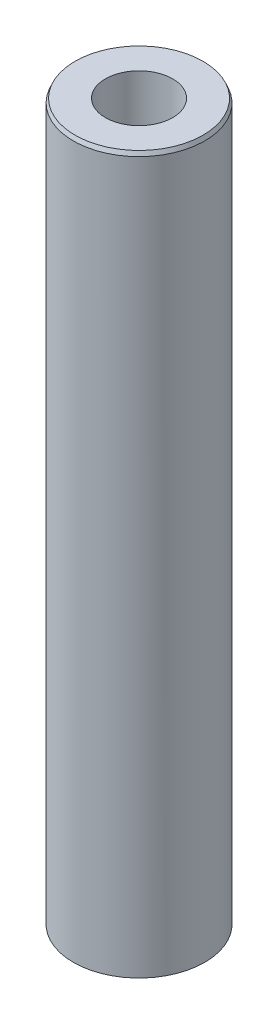
ISO-10303-21;
HEADER;
FILE_DESCRIPTION(('STEP AP214'),'2;1');
FILE_NAME('part.step','',(''),(''),'','','');
FILE_SCHEMA(('AUTOMOTIVE_DESIGN { 1 0 10303 214 1 1 1 1 }'));
ENDSEC;
DATA;
#1=APPLICATION_CONTEXT('core data for automotive mechanical design processes');
#2=APPLICATION_PROTOCOL_DEFINITION('international standard','automotive_design',2000,#1);
#3=PRODUCT_CONTEXT('',#1,'mechanical');
#4=PRODUCT('Part','Part','',(#3));
#5=PRODUCT_RELATED_PRODUCT_CATEGORY('part','',(#4));
#6=PRODUCT_DEFINITION_FORMATION('','',#4);
#7=PRODUCT_DEFINITION_CONTEXT('part definition',#1,'design');
#8=PRODUCT_DEFINITION('design','',#6,#7);
#9=PRODUCT_DEFINITION_SHAPE('','',#8);
#10=(LENGTH_UNIT() NAMED_UNIT(*) SI_UNIT(.MILLI.,.METRE.));
#11=(NAMED_UNIT(*) PLANE_ANGLE_UNIT() SI_UNIT($,.RADIAN.));
#12=(NAMED_UNIT(*) SI_UNIT($,.STERADIAN.) SOLID_ANGLE_UNIT());
#13=UNCERTAINTY_MEASURE_WITH_UNIT(LENGTH_MEASURE(1.E-05),#10,'distance_accuracy_value','');
#14=(GEOMETRIC_REPRESENTATION_CONTEXT(3) GLOBAL_UNCERTAINTY_ASSIGNED_CONTEXT((#13)) GLOBAL_UNIT_ASSIGNED_CONTEXT((#10,
#11,#12)) REPRESENTATION_CONTEXT('',''));
#15=CARTESIAN_POINT('',(0.,0.,0.));
#16=DIRECTION('',(0.,0.,1.));
#17=DIRECTION('',(1.,0.,0.));
#18=AXIS2_PLACEMENT_3D('',#15,#16,#17);
#19=CARTESIAN_POINT('',(0.,600.,0.));
#20=DIRECTION('',(0.,-1.,0.));
#21=DIRECTION('',(0.,0.,-1.));
#22=AXIS2_PLACEMENT_3D('',#19,#20,#21);
#23=CYLINDRICAL_SURFACE('',#22,55.);
#24=CARTESIAN_POINT('',(0.,596.561603427127,0.));
#25=DIRECTION('',(0.,1.,0.));
#26=DIRECTION('',(0.,0.,1.));
#27=AXIS2_PLACEMENT_3D('',#24,#25,#26);
#28=CIRCLE('',#27,55.);
#29=CARTESIAN_POINT('',(0.,596.561603427127,-55.));
#30=VERTEX_POINT('',#29);
#31=EDGE_CURVE('E50',#30,#30,#28,.F.);
#32=ORIENTED_EDGE('',*,*,#31,.T.);
#33=EDGE_LOOP('',(#32));
#34=FACE_BOUND('',#33,.T.);
#35=CARTESIAN_POINT('',(0.,1.44030875950241,0.));
#36=DIRECTION('',(0.,1.,0.));
#37=DIRECTION('',(0.,0.,1.));
#38=AXIS2_PLACEMENT_3D('',#35,#36,#37);
#39=CIRCLE('',#38,55.);
#40=CARTESIAN_POINT('',(0.,1.44030875950241,55.));
#41=VERTEX_POINT('',#40);
#42=EDGE_CURVE('E51',#41,#41,#39,.T.);
#43=ORIENTED_EDGE('',*,*,#42,.T.);
#44=EDGE_LOOP('',(#43));
#45=FACE_BOUND('',#44,.T.);
#46=ADVANCED_FACE('F39',(#34,#45),#23,.T.);
#47=CARTESIAN_POINT('',(0.,600.,0.));
#48=DIRECTION('',(0.,1.,0.));
#49=DIRECTION('',(0.,0.,1.));
#50=AXIS2_PLACEMENT_3D('',#47,#48,#49);
#51=PLANE('',#50);
#52=CARTESIAN_POINT('',(0.,600.,0.));
#53=DIRECTION('',(0.,1.,0.));
#54=DIRECTION('',(0.,0.,1.));
#55=AXIS2_PLACEMENT_3D('',#52,#53,#54);
#56=CIRCLE('',#55,53.5596912404976);
#57=CARTESIAN_POINT('',(0.,600.,-53.5596912404976));
#58=VERTEX_POINT('',#57);
#59=EDGE_CURVE('E54',#58,#58,#56,.T.);
#60=ORIENTED_EDGE('',*,*,#59,.T.);
#61=EDGE_LOOP('',(#60));
#62=FACE_BOUND('',#61,.T.);
#63=CARTESIAN_POINT('',(0.,600.,0.));
#64=DIRECTION('',(0.,1.,0.));
#65=DIRECTION('',(0.,0.,1.));
#66=AXIS2_PLACEMENT_3D('',#63,#64,#65);
#67=CIRCLE('',#66,28.1390764335335);
#68=CARTESIAN_POINT('',(0.,600.,28.1390764335335));
#69=VERTEX_POINT('',#68);
#70=EDGE_CURVE('E58',#69,#69,#67,.T.);
#71=ORIENTED_EDGE('',*,*,#70,.F.);
#72=EDGE_LOOP('',(#71));
#73=FACE_BOUND('',#72,.T.);
#74=ADVANCED_FACE('F69',(#62,#73),#51,.T.);
#75=CARTESIAN_POINT('',(0.,0.,0.));
#76=DIRECTION('',(0.,1.,0.));
#77=DIRECTION('',(0.,0.,1.));
#78=AXIS2_PLACEMENT_3D('',#75,#76,#77);
#79=PLANE('',#78);
#80=CARTESIAN_POINT('',(0.,0.,0.));
#81=DIRECTION('',(0.,1.,0.));
#82=DIRECTION('',(0.,0.,1.));
#83=AXIS2_PLACEMENT_3D('',#80,#81,#82);
#84=CIRCLE('',#83,51.5616034271273);
#85=CARTESIAN_POINT('',(0.,0.,51.5616034271273));
#86=VERTEX_POINT('',#85);
#87=EDGE_CURVE('E10',#86,#86,#84,.F.);
#88=ORIENTED_EDGE('',*,*,#87,.T.);
#89=EDGE_LOOP('',(#88));
#90=FACE_BOUND('',#89,.T.);
#91=CARTESIAN_POINT('',(0.,0.,0.));
#92=DIRECTION('',(0.,1.,0.));
#93=DIRECTION('',(0.,0.,1.));
#94=AXIS2_PLACEMENT_3D('',#91,#92,#93);
#95=CIRCLE('',#94,28.1390764335335);
#96=CARTESIAN_POINT('',(0.,0.,28.1390764335335));
#97=VERTEX_POINT('',#96);
#98=EDGE_CURVE('E63',#97,#97,#95,.T.);
#99=ORIENTED_EDGE('',*,*,#98,.T.);
#100=EDGE_LOOP('',(#99));
#101=FACE_BOUND('',#100,.T.);
#102=ADVANCED_FACE('F75',(#90,#101),#79,.F.);
#103=CARTESIAN_POINT('',(0.,600.,0.));
#104=DIRECTION('',(0.,-1.,0.));
#105=DIRECTION('',(0.,0.,-1.));
#106=AXIS2_PLACEMENT_3D('',#103,#104,#105);
#107=CYLINDRICAL_SURFACE('',#106,28.1390764335335);
#108=ORIENTED_EDGE('',*,*,#70,.T.);
#109=EDGE_LOOP('',(#108));
#110=FACE_BOUND('',#109,.T.);
#111=ORIENTED_EDGE('',*,*,#98,.F.);
#112=EDGE_LOOP('',(#111));
#113=FACE_BOUND('',#112,.T.);
#114=ADVANCED_FACE('F70',(#110,#113),#107,.F.);
#115=CARTESIAN_POINT('',(0.,600.,0.));
#116=DIRECTION('',(0.,-1.,0.));
#117=DIRECTION('',(0.,0.,-1.));
#118=AXIS2_PLACEMENT_3D('',#115,#116,#117);
#119=CONICAL_SURFACE('',#118,53.5596912404976,0.396683768936142);
#120=CARTESIAN_POINT('',(0.,596.561603427127,-55.));
#121=CARTESIAN_POINT('',(0.,596.597420058095,-54.9849967837552));
#122=CARTESIAN_POINT('',(0.,596.633236689062,-54.9699935675104));
#123=CARTESIAN_POINT('',(0.,596.704869950997,-54.9399871350208));
#124=CARTESIAN_POINT('',(0.,596.740686581964,-54.9249839187759));
#125=CARTESIAN_POINT('',(0.,596.812319843899,-54.8949774862863));
#126=CARTESIAN_POINT('',(0.,596.848136474867,-54.8799742700415));
#127=CARTESIAN_POINT('',(0.,596.919769736802,-54.8499678375519));
#128=CARTESIAN_POINT('',(0.,596.955586367769,-54.834964621307));
#129=CARTESIAN_POINT('',(0.,597.027219629704,-54.8049581888174));
#130=CARTESIAN_POINT('',(0.,597.063036260671,-54.7899549725726));
#131=CARTESIAN_POINT('',(0.,597.134669522606,-54.759948540083));
#132=CARTESIAN_POINT('',(0.,597.170486153574,-54.7449453238381));
#133=CARTESIAN_POINT('',(0.,597.242119415508,-54.7149388913485));
#134=CARTESIAN_POINT('',(0.,597.277936046476,-54.6999356751037));
#135=CARTESIAN_POINT('',(0.,597.349569308411,-54.6699292426141));
#136=CARTESIAN_POINT('',(0.,597.385385939378,-54.6549260263692));
#137=CARTESIAN_POINT('',(0.,597.457019201313,-54.6249195938796));
#138=CARTESIAN_POINT('',(0.,597.49283583228,-54.6099163776348));
#139=CARTESIAN_POINT('',(0.,597.564469094215,-54.5799099451452));
#140=CARTESIAN_POINT('',(0.,597.600285725183,-54.5649067289003));
#141=CARTESIAN_POINT('',(0.,597.671918987117,-54.5349002964107));
#142=CARTESIAN_POINT('',(0.,597.707735618085,-54.5198970801659));
#143=CARTESIAN_POINT('',(0.,597.77936888002,-54.4898906476763));
#144=CARTESIAN_POINT('',(0.,597.815185510987,-54.4748874314314));
#145=CARTESIAN_POINT('',(0.,597.886818772922,-54.4448809989418));
#146=CARTESIAN_POINT('',(0.,597.922635403889,-54.429877782697));
#147=CARTESIAN_POINT('',(0.,597.994268665824,-54.3998713502073));
#148=CARTESIAN_POINT('',(0.,598.030085296792,-54.3848681339625));
#149=CARTESIAN_POINT('',(0.,598.101718558726,-54.3548617014729));
#150=CARTESIAN_POINT('',(0.,598.137535189694,-54.3398584852281));
#151=CARTESIAN_POINT('',(0.,598.209168451629,-54.3098520527385));
#152=CARTESIAN_POINT('',(0.,598.244985082596,-54.2948488364936));
#153=CARTESIAN_POINT('',(0.,598.316618344531,-54.264842404004));
#154=CARTESIAN_POINT('',(0.,598.352434975498,-54.2498391877592));
#155=CARTESIAN_POINT('',(0.,598.424068237433,-54.2198327552695));
#156=CARTESIAN_POINT('',(0.,598.459884868401,-54.2048295390247));
#157=CARTESIAN_POINT('',(0.,598.531518130336,-54.1748231065351));
#158=CARTESIAN_POINT('',(0.,598.567334761303,-54.1598198902903));
#159=CARTESIAN_POINT('',(0.,598.638968023238,-54.1298134578006));
#160=CARTESIAN_POINT('',(0.,598.674784654205,-54.1148102415558));
#161=CARTESIAN_POINT('',(0.,598.74641791614,-54.0848038090662));
#162=CARTESIAN_POINT('',(0.,598.782234547108,-54.0698005928214));
#163=CARTESIAN_POINT('',(0.,598.853867809042,-54.0397941603318));
#164=CARTESIAN_POINT('',(0.,598.88968444001,-54.0247909440869));
#165=CARTESIAN_POINT('',(0.,598.961317701945,-53.9947845115973));
#166=CARTESIAN_POINT('',(0.,598.997134332912,-53.9797812953525));
#167=CARTESIAN_POINT('',(0.,599.068767594847,-53.9497748628628));
#168=CARTESIAN_POINT('',(0.,599.104584225814,-53.934771646618));
#169=CARTESIAN_POINT('',(0.,599.176217487749,-53.9047652141284));
#170=CARTESIAN_POINT('',(0.,599.212034118717,-53.8897619978836));
#171=CARTESIAN_POINT('',(0.,599.283667380651,-53.8597555653939));
#172=CARTESIAN_POINT('',(0.,599.319484011619,-53.8447523491491));
#173=CARTESIAN_POINT('',(0.,599.391117273554,-53.8147459166595));
#174=CARTESIAN_POINT('',(0.,599.426933904521,-53.7997427004147));
#175=CARTESIAN_POINT('',(0.,599.498567166456,-53.7697362679251));
#176=CARTESIAN_POINT('',(0.,599.534383797423,-53.7547330516802));
#177=CARTESIAN_POINT('',(0.,599.606017059358,-53.7247266191906));
#178=CARTESIAN_POINT('',(0.,599.641833690326,-53.7097234029458));
#179=CARTESIAN_POINT('',(0.,599.71346695226,-53.6797169704561));
#180=CARTESIAN_POINT('',(0.,599.749283583228,-53.6647137542113));
#181=CARTESIAN_POINT('',(0.,599.820916845163,-53.6347073217217));
#182=CARTESIAN_POINT('',(0.,599.85673347613,-53.6197041054769));
#183=CARTESIAN_POINT('',(0.,599.928366738065,-53.5896976729872));
#184=CARTESIAN_POINT('',(0.,599.964183369033,-53.5746944567424));
#185=CARTESIAN_POINT('',(0.,600.,-53.5596912404976));
#186=B_SPLINE_CURVE_WITH_KNOTS('',3,(#120,#121,#122,#123,#124,#125,#126,#127,#128,#129,#130,
#131,#132,#133,#134,#135,#136,#137,#138,#139,#140,#141,#142,#143,#144,#145,#146,#147,#148,#149,
#150,#151,#152,#153,#154,#155,#156,#157,#158,#159,#160,#161,#162,#163,#164,#165,#166,#167,#168,
#169,#170,#171,#172,#173,#174,#175,#176,#177,#178,#179,#180,#181,#182,#183,#184,#185),
.UNSPECIFIED.,.F.,.F.,(4,2,2,2,2,2,2,2,2,2,2,2,2,2,2,2,2,2,2,2,2,2,2,2,2,2,2,2,2,2,2,2,4),(0.,
0.116496128536204,0.232992257072307,0.349488385608511,0.465984514144615,0.582480642680716,
0.698976771216922,0.815472899753023,0.931969028289127,1.04846515682533,1.16496128536143,
1.28145741389754,1.39795354243374,1.51444967096985,1.63094579950595,1.74744192804215,
1.86393805657825,1.98043418511436,2.09693031365056,2.21342644218667,2.32992257072277,
2.44641869925897,2.56291482779507,2.67941095633118,2.79590708486738,2.91240321340349,
3.02889934193959,3.14539547047579,3.2618915990119,3.378387727548,3.4948838560842,
3.61137998462031,3.72787611315651),.UNSPECIFIED.);
#187=EDGE_CURVE('BSEAM81',#30,#58,#186,.T.);
#188=ORIENTED_EDGE('',*,*,#31,.F.);
#189=ORIENTED_EDGE('',*,*,#59,.F.);
#190=ORIENTED_EDGE('',*,*,#187,.T.);
#191=ORIENTED_EDGE('',*,*,#187,.F.);
#192=EDGE_LOOP('',(#188,#190,#189,#191));
#193=FACE_BOUND('',#192,.T.);
#194=ADVANCED_FACE('F81',(#193),#119,.T.);
#195=CARTESIAN_POINT('',(0.,1.44030875950241,0.));
#196=DIRECTION('',(0.,1.,0.));
#197=DIRECTION('',(0.,0.,1.));
#198=AXIS2_PLACEMENT_3D('',#195,#196,#197);
#199=CONICAL_SURFACE('',#198,55.,1.17411255785875);
#200=ORIENTED_EDGE('',*,*,#87,.F.);
#201=EDGE_LOOP('',(#200));
#202=FACE_BOUND('',#201,.T.);
#203=ORIENTED_EDGE('',*,*,#42,.F.);
#204=EDGE_LOOP('',(#203));
#205=FACE_BOUND('',#204,.T.);
#206=ADVANCED_FACE('F45',(#202,#205),#199,.T.);
#207=CLOSED_SHELL('',(#46,#74,#102,#114,#194,#206));
#208=MANIFOLD_SOLID_BREP('B2',#207);
#209=ADVANCED_BREP_SHAPE_REPRESENTATION('',(#18,#208),#14);
#210=SHAPE_DEFINITION_REPRESENTATION(#9,#209);
ENDSEC;
END-ISO-10303-21;
